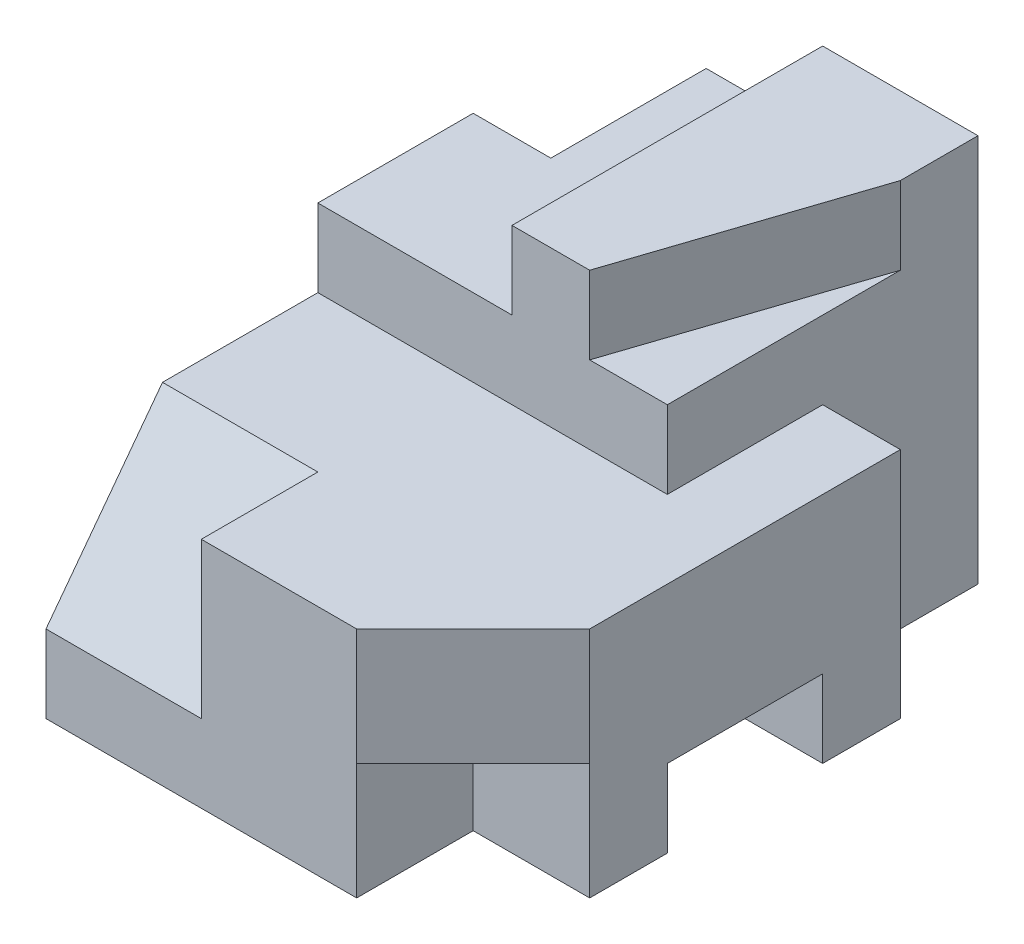
ISO-10303-21;
HEADER;
FILE_DESCRIPTION(('STEP AP214'),'2;1');
FILE_NAME('part.step','',(''),(''),'','','');
FILE_SCHEMA(('AUTOMOTIVE_DESIGN { 1 0 10303 214 1 1 1 1 }'));
ENDSEC;
DATA;
#1=APPLICATION_CONTEXT('core data for automotive mechanical design processes');
#2=APPLICATION_PROTOCOL_DEFINITION('international standard','automotive_design',2000,#1);
#3=PRODUCT_CONTEXT('',#1,'mechanical');
#4=PRODUCT('Part','Part','',(#3));
#5=PRODUCT_RELATED_PRODUCT_CATEGORY('part','',(#4));
#6=PRODUCT_DEFINITION_FORMATION('','',#4);
#7=PRODUCT_DEFINITION_CONTEXT('part definition',#1,'design');
#8=PRODUCT_DEFINITION('design','',#6,#7);
#9=PRODUCT_DEFINITION_SHAPE('','',#8);
#10=(LENGTH_UNIT() NAMED_UNIT(*) SI_UNIT(.MILLI.,.METRE.));
#11=(NAMED_UNIT(*) PLANE_ANGLE_UNIT() SI_UNIT($,.RADIAN.));
#12=(NAMED_UNIT(*) SI_UNIT($,.STERADIAN.) SOLID_ANGLE_UNIT());
#13=UNCERTAINTY_MEASURE_WITH_UNIT(LENGTH_MEASURE(1.E-05),#10,'distance_accuracy_value','');
#14=(GEOMETRIC_REPRESENTATION_CONTEXT(3) GLOBAL_UNCERTAINTY_ASSIGNED_CONTEXT((#13)) GLOBAL_UNIT_ASSIGNED_CONTEXT((#10,
#11,#12)) REPRESENTATION_CONTEXT('',''));
#15=CARTESIAN_POINT('',(0.,0.,0.));
#16=DIRECTION('',(0.,0.,1.));
#17=DIRECTION('',(1.,0.,0.));
#18=AXIS2_PLACEMENT_3D('',#15,#16,#17);
#19=CARTESIAN_POINT('',(2.75,-2.5,7.5));
#20=DIRECTION('',(0.,1.,0.));
#21=DIRECTION('',(-1.,0.,0.));
#22=AXIS2_PLACEMENT_3D('',#19,#20,#21);
#23=PLANE('',#22);
#24=DIRECTION('',(0.,0.,-1.));
#25=VECTOR('',#24,1.);
#26=CARTESIAN_POINT('',(2.75,-2.5,7.5));
#27=LINE('',#26,#25);
#28=CARTESIAN_POINT('',(2.75,-2.5,6.));
#29=VERTEX_POINT('',#28);
#30=CARTESIAN_POINT('',(2.75,-2.5,5.));
#31=VERTEX_POINT('',#30);
#32=EDGE_CURVE('E212',#29,#31,#27,.T.);
#33=ORIENTED_EDGE('',*,*,#32,.F.);
#34=DIRECTION('',(1.,0.,0.));
#35=VECTOR('',#34,1.);
#36=CARTESIAN_POINT('',(1.25,-2.5,6.));
#37=LINE('',#36,#35);
#38=CARTESIAN_POINT('',(1.25,-2.5,6.));
#39=VERTEX_POINT('',#38);
#40=EDGE_CURVE('E193',#39,#29,#37,.T.);
#41=ORIENTED_EDGE('',*,*,#40,.F.);
#42=DIRECTION('',(0.,0.,-1.));
#43=VECTOR('',#42,1.);
#44=CARTESIAN_POINT('',(1.25,-2.5,7.5));
#45=LINE('',#44,#43);
#46=CARTESIAN_POINT('',(1.25,-2.5,7.5));
#47=VERTEX_POINT('',#46);
#48=EDGE_CURVE('E200',#47,#39,#45,.T.);
#49=ORIENTED_EDGE('',*,*,#48,.F.);
#50=DIRECTION('',(1.,0.,0.));
#51=VECTOR('',#50,1.);
#52=CARTESIAN_POINT('',(2.75,-2.5,7.5));
#53=LINE('',#52,#51);
#54=CARTESIAN_POINT('',(-2.75,-2.5,7.5));
#55=VERTEX_POINT('',#54);
#56=EDGE_CURVE('E357',#55,#47,#53,.T.);
#57=ORIENTED_EDGE('',*,*,#56,.F.);
#58=DIRECTION('',(0.,0.,-1.));
#59=VECTOR('',#58,1.);
#60=CARTESIAN_POINT('',(-2.75,-2.5,7.5));
#61=LINE('',#60,#59);
#62=CARTESIAN_POINT('',(-2.75,-2.5,5.));
#63=VERTEX_POINT('',#62);
#64=EDGE_CURVE('E41',#55,#63,#61,.T.);
#65=ORIENTED_EDGE('',*,*,#64,.T.);
#66=DIRECTION('',(1.,0.,0.));
#67=VECTOR('',#66,1.);
#68=CARTESIAN_POINT('',(-2.75,-2.5,5.));
#69=LINE('',#68,#67);
#70=EDGE_CURVE('E240',#63,#31,#69,.T.);
#71=ORIENTED_EDGE('',*,*,#70,.T.);
#72=EDGE_LOOP('',(#33,#41,#49,#57,#65,#71));
#73=FACE_BOUND('',#72,.T.);
#74=ADVANCED_FACE('F33',(#73),#23,.F.);
#75=CARTESIAN_POINT('',(-2.75,-2.5,7.5));
#76=DIRECTION('',(1.,0.,0.));
#77=DIRECTION('',(0.,0.,-1.));
#78=AXIS2_PLACEMENT_3D('',#75,#76,#77);
#79=PLANE('',#78);
#80=DIRECTION('',(0.,0.,1.));
#81=VECTOR('',#80,1.);
#82=CARTESIAN_POINT('',(-2.75,-1.5,5.));
#83=LINE('',#82,#81);
#84=CARTESIAN_POINT('',(-2.75,-1.5,3.));
#85=VERTEX_POINT('',#84);
#86=CARTESIAN_POINT('',(-2.75,-1.5,5.));
#87=VERTEX_POINT('',#86);
#88=EDGE_CURVE('E225',#85,#87,#83,.T.);
#89=ORIENTED_EDGE('',*,*,#88,.T.);
#90=DIRECTION('',(0.,-1.,0.));
#91=VECTOR('',#90,1.);
#92=CARTESIAN_POINT('',(-2.75,-2.5,5.));
#93=LINE('',#92,#91);
#94=EDGE_CURVE('E229',#87,#63,#93,.T.);
#95=ORIENTED_EDGE('',*,*,#94,.T.);
#96=ORIENTED_EDGE('',*,*,#64,.F.);
#97=DIRECTION('',(0.,-1.,0.));
#98=VECTOR('',#97,1.);
#99=CARTESIAN_POINT('',(-2.75,-2.5,7.5));
#100=LINE('',#99,#98);
#101=CARTESIAN_POINT('',(-2.75,-1.5,7.5));
#102=VERTEX_POINT('',#101);
#103=EDGE_CURVE('E355',#102,#55,#100,.T.);
#104=ORIENTED_EDGE('',*,*,#103,.F.);
#105=DIRECTION('',(0.,-0.8,0.6));
#106=VECTOR('',#105,1.);
#107=CARTESIAN_POINT('',(-2.75,0.499999999999999,6.));
#108=LINE('',#107,#106);
#109=CARTESIAN_POINT('',(-2.75,0.499999999999999,6.));
#110=VERTEX_POINT('',#109);
#111=EDGE_CURVE('E296',#110,#102,#108,.T.);
#112=ORIENTED_EDGE('',*,*,#111,.F.);
#113=DIRECTION('',(0.,0.,1.));
#114=VECTOR('',#113,1.);
#115=CARTESIAN_POINT('',(-2.75,0.499999999999999,0.));
#116=LINE('',#115,#114);
#117=CARTESIAN_POINT('',(-2.75,0.499999999999999,4.));
#118=VERTEX_POINT('',#117);
#119=EDGE_CURVE('E306',#118,#110,#116,.T.);
#120=ORIENTED_EDGE('',*,*,#119,.F.);
#121=DIRECTION('',(0.,1.,0.));
#122=VECTOR('',#121,1.);
#123=CARTESIAN_POINT('',(-2.75,0.499999999999999,4.));
#124=LINE('',#123,#122);
#125=CARTESIAN_POINT('',(-2.75,1.5,4.));
#126=VERTEX_POINT('',#125);
#127=EDGE_CURVE('E317',#118,#126,#124,.T.);
#128=ORIENTED_EDGE('',*,*,#127,.T.);
#129=DIRECTION('',(0.,0.,1.));
#130=VECTOR('',#129,1.);
#131=CARTESIAN_POINT('',(-2.75,1.5,0.));
#132=LINE('',#131,#130);
#133=CARTESIAN_POINT('',(-2.75,1.5,2.));
#134=VERTEX_POINT('',#133);
#135=EDGE_CURVE('E266',#134,#126,#132,.T.);
#136=ORIENTED_EDGE('',*,*,#135,.F.);
#137=DIRECTION('',(0.,1.,0.));
#138=VECTOR('',#137,1.);
#139=CARTESIAN_POINT('',(-2.75,-2.5,2.));
#140=LINE('',#139,#138);
#141=CARTESIAN_POINT('',(-2.75,-2.5,2.));
#142=VERTEX_POINT('',#141);
#143=EDGE_CURVE('E255',#142,#134,#140,.T.);
#144=ORIENTED_EDGE('',*,*,#143,.F.);
#145=CARTESIAN_POINT('',(-2.75,-2.5,3.));
#146=VERTEX_POINT('',#145);
#147=EDGE_CURVE('E364',#146,#142,#61,.T.);
#148=ORIENTED_EDGE('',*,*,#147,.F.);
#149=DIRECTION('',(0.,1.,0.));
#150=VECTOR('',#149,1.);
#151=CARTESIAN_POINT('',(-2.75,-1.5,3.));
#152=LINE('',#151,#150);
#153=EDGE_CURVE('E55',#146,#85,#152,.T.);
#154=ORIENTED_EDGE('',*,*,#153,.T.);
#155=EDGE_LOOP('',(#89,#95,#96,#104,#112,#120,#128,#136,#144,#148,#154));
#156=FACE_BOUND('',#155,.T.);
#157=ADVANCED_FACE('F35',(#156),#79,.F.);
#158=CARTESIAN_POINT('',(2.75,-2.5,7.5));
#159=DIRECTION('',(-1.,0.,0.));
#160=DIRECTION('',(0.,0.,1.));
#161=AXIS2_PLACEMENT_3D('',#158,#159,#160);
#162=PLANE('',#161);
#163=DIRECTION('',(0.,0.,-1.));
#164=VECTOR('',#163,1.);
#165=CARTESIAN_POINT('',(2.75,0.5,2.));
#166=LINE('',#165,#164);
#167=CARTESIAN_POINT('',(2.75,0.5,6.));
#168=VERTEX_POINT('',#167);
#169=CARTESIAN_POINT('',(2.75,0.5,2.));
#170=VERTEX_POINT('',#169);
#171=EDGE_CURVE('E321',#168,#170,#166,.T.);
#172=ORIENTED_EDGE('',*,*,#171,.F.);
#173=DIRECTION('',(0.,1.,0.));
#174=VECTOR('',#173,1.);
#175=CARTESIAN_POINT('',(2.75,-2.5,6.));
#176=LINE('',#175,#174);
#177=CARTESIAN_POINT('',(2.75,-1.,6.));
#178=VERTEX_POINT('',#177);
#179=EDGE_CURVE('E47',#178,#168,#176,.T.);
#180=ORIENTED_EDGE('',*,*,#179,.F.);
#181=EDGE_CURVE('E222',#29,#178,#176,.T.);
#182=ORIENTED_EDGE('',*,*,#181,.F.);
#183=ORIENTED_EDGE('',*,*,#32,.T.);
#184=DIRECTION('',(0.,-1.,0.));
#185=VECTOR('',#184,1.);
#186=CARTESIAN_POINT('',(2.75,-2.5,5.));
#187=LINE('',#186,#185);
#188=CARTESIAN_POINT('',(2.75,-1.5,5.));
#189=VERTEX_POINT('',#188);
#190=EDGE_CURVE('E226',#189,#31,#187,.T.);
#191=ORIENTED_EDGE('',*,*,#190,.F.);
#192=DIRECTION('',(0.,0.,1.));
#193=VECTOR('',#192,1.);
#194=CARTESIAN_POINT('',(2.75,-1.5,5.));
#195=LINE('',#194,#193);
#196=CARTESIAN_POINT('',(2.75,-1.5,3.));
#197=VERTEX_POINT('',#196);
#198=EDGE_CURVE('E235',#197,#189,#195,.T.);
#199=ORIENTED_EDGE('',*,*,#198,.F.);
#200=DIRECTION('',(0.,1.,0.));
#201=VECTOR('',#200,1.);
#202=CARTESIAN_POINT('',(2.75,-1.5,3.));
#203=LINE('',#202,#201);
#204=CARTESIAN_POINT('',(2.75,-2.5,3.));
#205=VERTEX_POINT('',#204);
#206=EDGE_CURVE('E220',#205,#197,#203,.T.);
#207=ORIENTED_EDGE('',*,*,#206,.F.);
#208=CARTESIAN_POINT('',(2.75,-2.5,2.));
#209=VERTEX_POINT('',#208);
#210=EDGE_CURVE('E360',#205,#209,#27,.T.);
#211=ORIENTED_EDGE('',*,*,#210,.T.);
#212=DIRECTION('',(0.,-1.,0.));
#213=VECTOR('',#212,1.);
#214=CARTESIAN_POINT('',(2.75,-2.5,2.));
#215=LINE('',#214,#213);
#216=EDGE_CURVE('E325',#170,#209,#215,.T.);
#217=ORIENTED_EDGE('',*,*,#216,.F.);
#218=EDGE_LOOP('',(#172,#180,#182,#183,#191,#199,#207,#211,#217));
#219=FACE_BOUND('',#218,.T.);
#220=ADVANCED_FACE('F415',(#219),#162,.F.);
#221=CARTESIAN_POINT('',(2.75,2.5,7.5));
#222=DIRECTION('',(0.,-1.,0.));
#223=DIRECTION('',(1.,0.,0.));
#224=AXIS2_PLACEMENT_3D('',#221,#222,#223);
#225=PLANE('',#224);
#226=DIRECTION('',(-1.,0.,0.));
#227=VECTOR('',#226,1.);
#228=CARTESIAN_POINT('',(2.75,2.5,0.));
#229=LINE('',#228,#227);
#230=CARTESIAN_POINT('',(1.75,2.5,0.));
#231=VERTEX_POINT('',#230);
#232=CARTESIAN_POINT('',(-0.25,2.5,0.));
#233=VERTEX_POINT('',#232);
#234=EDGE_CURVE('E358',#231,#233,#229,.T.);
#235=ORIENTED_EDGE('',*,*,#234,.T.);
#236=DIRECTION('',(0.,0.,-1.));
#237=VECTOR('',#236,1.);
#238=CARTESIAN_POINT('',(-0.25,2.5,4.));
#239=LINE('',#238,#237);
#240=CARTESIAN_POINT('',(-0.25,2.5,4.));
#241=VERTEX_POINT('',#240);
#242=EDGE_CURVE('E262',#241,#233,#239,.T.);
#243=ORIENTED_EDGE('',*,*,#242,.F.);
#244=DIRECTION('',(1.,0.,0.));
#245=VECTOR('',#244,1.);
#246=CARTESIAN_POINT('',(0.,2.5,4.));
#247=LINE('',#246,#245);
#248=CARTESIAN_POINT('',(0.749999999999999,2.5,4.));
#249=VERTEX_POINT('',#248);
#250=EDGE_CURVE('E301',#241,#249,#247,.T.);
#251=ORIENTED_EDGE('',*,*,#250,.T.);
#252=DIRECTION('',(-0.316227766016838,0.,0.948683298050514));
#253=VECTOR('',#252,1.);
#254=CARTESIAN_POINT('',(1.75,2.5,1.));
#255=LINE('',#254,#253);
#256=CARTESIAN_POINT('',(1.75,2.5,1.));
#257=VERTEX_POINT('',#256);
#258=EDGE_CURVE('E282',#257,#249,#255,.T.);
#259=ORIENTED_EDGE('',*,*,#258,.F.);
#260=DIRECTION('',(0.,0.,1.));
#261=VECTOR('',#260,1.);
#262=CARTESIAN_POINT('',(1.75,2.5,4.));
#263=LINE('',#262,#261);
#264=EDGE_CURVE('E324',#231,#257,#263,.T.);
#265=ORIENTED_EDGE('',*,*,#264,.F.);
#266=EDGE_LOOP('',(#235,#243,#251,#259,#265));
#267=FACE_BOUND('',#266,.T.);
#268=ADVANCED_FACE('F393',(#267),#225,.F.);
#269=CARTESIAN_POINT('',(0.,0.,7.5));
#270=DIRECTION('',(0.,0.,1.));
#271=DIRECTION('',(1.,0.,0.));
#272=AXIS2_PLACEMENT_3D('',#269,#270,#271);
#273=PLANE('',#272);
#274=DIRECTION('',(0.,1.,0.));
#275=VECTOR('',#274,1.);
#276=CARTESIAN_POINT('',(1.25,-2.5,7.5));
#277=LINE('',#276,#275);
#278=CARTESIAN_POINT('',(1.25,-1.,7.5));
#279=VERTEX_POINT('',#278);
#280=EDGE_CURVE('E205',#47,#279,#277,.T.);
#281=ORIENTED_EDGE('',*,*,#280,.T.);
#282=CARTESIAN_POINT('',(1.25,0.5,7.5));
#283=VERTEX_POINT('',#282);
#284=EDGE_CURVE('E221',#279,#283,#277,.T.);
#285=ORIENTED_EDGE('',*,*,#284,.T.);
#286=DIRECTION('',(1.,0.,0.));
#287=VECTOR('',#286,1.);
#288=CARTESIAN_POINT('',(0.,0.5,7.5));
#289=LINE('',#288,#287);
#290=CARTESIAN_POINT('',(-0.749999999999999,0.5,7.5));
#291=VERTEX_POINT('',#290);
#292=EDGE_CURVE('E314',#291,#283,#289,.T.);
#293=ORIENTED_EDGE('',*,*,#292,.F.);
#294=DIRECTION('',(0.,1.,0.));
#295=VECTOR('',#294,1.);
#296=CARTESIAN_POINT('',(-0.75,-1.5,7.5));
#297=LINE('',#296,#295);
#298=CARTESIAN_POINT('',(-0.75,-1.5,7.5));
#299=VERTEX_POINT('',#298);
#300=EDGE_CURVE('E346',#299,#291,#297,.T.);
#301=ORIENTED_EDGE('',*,*,#300,.F.);
#302=DIRECTION('',(-1.,0.,0.));
#303=VECTOR('',#302,1.);
#304=CARTESIAN_POINT('',(-0.75,-1.5,7.5));
#305=LINE('',#304,#303);
#306=EDGE_CURVE('E351',#299,#102,#305,.T.);
#307=ORIENTED_EDGE('',*,*,#306,.T.);
#308=ORIENTED_EDGE('',*,*,#103,.T.);
#309=ORIENTED_EDGE('',*,*,#56,.T.);
#310=EDGE_LOOP('',(#281,#285,#293,#301,#307,#308,#309));
#311=FACE_BOUND('',#310,.T.);
#312=ADVANCED_FACE('F451',(#311),#273,.T.);
#313=CARTESIAN_POINT('',(-0.75,0.,0.));
#314=DIRECTION('',(1.,0.,0.));
#315=DIRECTION('',(0.,0.,-1.));
#316=AXIS2_PLACEMENT_3D('',#313,#314,#315);
#317=PLANE('',#316);
#318=ORIENTED_EDGE('',*,*,#300,.T.);
#319=DIRECTION('',(0.,0.,1.));
#320=VECTOR('',#319,1.);
#321=CARTESIAN_POINT('',(-0.749999999999999,0.5,0.));
#322=LINE('',#321,#320);
#323=CARTESIAN_POINT('',(-0.749999999999999,0.5,6.));
#324=VERTEX_POINT('',#323);
#325=EDGE_CURVE('E312',#324,#291,#322,.T.);
#326=ORIENTED_EDGE('',*,*,#325,.F.);
#327=DIRECTION('',(0.,-0.8,0.6));
#328=VECTOR('',#327,1.);
#329=CARTESIAN_POINT('',(-0.75,0.499999999999999,6.));
#330=LINE('',#329,#328);
#331=EDGE_CURVE('E298',#324,#299,#330,.T.);
#332=ORIENTED_EDGE('',*,*,#331,.T.);
#333=EDGE_LOOP('',(#318,#326,#332));
#334=FACE_BOUND('',#333,.T.);
#335=ADVANCED_FACE('F445',(#334),#317,.F.);
#336=ORIENTED_EDGE('',*,*,#210,.F.);
#337=DIRECTION('',(1.,0.,0.));
#338=VECTOR('',#337,1.);
#339=CARTESIAN_POINT('',(-2.75,-2.5,3.));
#340=LINE('',#339,#338);
#341=EDGE_CURVE('E232',#146,#205,#340,.T.);
#342=ORIENTED_EDGE('',*,*,#341,.F.);
#343=ORIENTED_EDGE('',*,*,#147,.T.);
#344=DIRECTION('',(1.,0.,0.));
#345=VECTOR('',#344,1.);
#346=CARTESIAN_POINT('',(-1.75,-2.5,2.));
#347=LINE('',#346,#345);
#348=CARTESIAN_POINT('',(-1.75,-2.5,2.));
#349=VERTEX_POINT('',#348);
#350=EDGE_CURVE('E248',#142,#349,#347,.T.);
#351=ORIENTED_EDGE('',*,*,#350,.T.);
#352=DIRECTION('',(0.,0.,-1.));
#353=VECTOR('',#352,1.);
#354=CARTESIAN_POINT('',(-1.75,-2.5,0.));
#355=LINE('',#354,#353);
#356=CARTESIAN_POINT('',(-1.75,-2.5,0.));
#357=VERTEX_POINT('',#356);
#358=EDGE_CURVE('E251',#349,#357,#355,.T.);
#359=ORIENTED_EDGE('',*,*,#358,.T.);
#360=DIRECTION('',(1.,0.,0.));
#361=VECTOR('',#360,1.);
#362=CARTESIAN_POINT('',(2.75,-2.5,0.));
#363=LINE('',#362,#361);
#364=CARTESIAN_POINT('',(1.75,-2.5,0.));
#365=VERTEX_POINT('',#364);
#366=EDGE_CURVE('E354',#357,#365,#363,.T.);
#367=ORIENTED_EDGE('',*,*,#366,.T.);
#368=DIRECTION('',(0.,0.,-1.));
#369=VECTOR('',#368,1.);
#370=CARTESIAN_POINT('',(1.75,-2.5,0.));
#371=LINE('',#370,#369);
#372=CARTESIAN_POINT('',(1.75,-2.5,2.));
#373=VERTEX_POINT('',#372);
#374=EDGE_CURVE('E336',#373,#365,#371,.T.);
#375=ORIENTED_EDGE('',*,*,#374,.F.);
#376=DIRECTION('',(1.,0.,0.));
#377=VECTOR('',#376,1.);
#378=CARTESIAN_POINT('',(1.75,-2.5,2.));
#379=LINE('',#378,#377);
#380=EDGE_CURVE('E343',#373,#209,#379,.T.);
#381=ORIENTED_EDGE('',*,*,#380,.T.);
#382=EDGE_LOOP('',(#336,#342,#343,#351,#359,#367,#375,#381));
#383=FACE_BOUND('',#382,.T.);
#384=ADVANCED_FACE('F371',(#383),#23,.F.);
#385=CARTESIAN_POINT('',(0.,0.,0.));
#386=DIRECTION('',(0.,0.,1.));
#387=DIRECTION('',(1.,0.,0.));
#388=AXIS2_PLACEMENT_3D('',#385,#386,#387);
#389=PLANE('',#388);
#390=ORIENTED_EDGE('',*,*,#366,.F.);
#391=DIRECTION('',(0.,1.,0.));
#392=VECTOR('',#391,1.);
#393=CARTESIAN_POINT('',(-1.75,-2.5,0.));
#394=LINE('',#393,#392);
#395=CARTESIAN_POINT('',(-1.75,1.5,0.));
#396=VERTEX_POINT('',#395);
#397=EDGE_CURVE('E259',#357,#396,#394,.T.);
#398=ORIENTED_EDGE('',*,*,#397,.T.);
#399=DIRECTION('',(-1.,0.,0.));
#400=VECTOR('',#399,1.);
#401=CARTESIAN_POINT('',(-0.25,1.5,0.));
#402=LINE('',#401,#400);
#403=CARTESIAN_POINT('',(-0.25,1.5,0.));
#404=VERTEX_POINT('',#403);
#405=EDGE_CURVE('E274',#404,#396,#402,.T.);
#406=ORIENTED_EDGE('',*,*,#405,.F.);
#407=DIRECTION('',(0.,1.,0.));
#408=VECTOR('',#407,1.);
#409=CARTESIAN_POINT('',(-0.25,1.5,0.));
#410=LINE('',#409,#408);
#411=EDGE_CURVE('E279',#404,#233,#410,.T.);
#412=ORIENTED_EDGE('',*,*,#411,.T.);
#413=ORIENTED_EDGE('',*,*,#234,.F.);
#414=DIRECTION('',(0.,1.,0.));
#415=VECTOR('',#414,1.);
#416=CARTESIAN_POINT('',(1.75,2.5,0.));
#417=LINE('',#416,#415);
#418=EDGE_CURVE('E322',#365,#231,#417,.T.);
#419=ORIENTED_EDGE('',*,*,#418,.F.);
#420=EDGE_LOOP('',(#390,#398,#406,#412,#413,#419));
#421=FACE_BOUND('',#420,.T.);
#422=ADVANCED_FACE('F400',(#421),#389,.F.);
#423=CARTESIAN_POINT('',(1.75,-2.5,2.));
#424=DIRECTION('',(0.,0.,1.));
#425=DIRECTION('',(1.,0.,0.));
#426=AXIS2_PLACEMENT_3D('',#423,#424,#425);
#427=PLANE('',#426);
#428=ORIENTED_EDGE('',*,*,#216,.T.);
#429=ORIENTED_EDGE('',*,*,#380,.F.);
#430=DIRECTION('',(0.,-1.,0.));
#431=VECTOR('',#430,1.);
#432=CARTESIAN_POINT('',(1.75,-2.5,2.));
#433=LINE('',#432,#431);
#434=CARTESIAN_POINT('',(1.75,0.5,2.));
#435=VERTEX_POINT('',#434);
#436=EDGE_CURVE('E333',#435,#373,#433,.T.);
#437=ORIENTED_EDGE('',*,*,#436,.F.);
#438=DIRECTION('',(1.,0.,0.));
#439=VECTOR('',#438,1.);
#440=CARTESIAN_POINT('',(1.75,0.5,2.));
#441=LINE('',#440,#439);
#442=EDGE_CURVE('E339',#435,#170,#441,.T.);
#443=ORIENTED_EDGE('',*,*,#442,.T.);
#444=EDGE_LOOP('',(#428,#429,#437,#443));
#445=FACE_BOUND('',#444,.T.);
#446=ADVANCED_FACE('F410',(#445),#427,.F.);
#447=CARTESIAN_POINT('',(1.75,0.5,2.));
#448=DIRECTION('',(0.,-1.,0.));
#449=DIRECTION('',(0.,0.,-1.));
#450=AXIS2_PLACEMENT_3D('',#447,#448,#449);
#451=PLANE('',#450);
#452=ORIENTED_EDGE('',*,*,#292,.T.);
#453=DIRECTION('',(-0.707106781186548,0.,0.707106781186547));
#454=VECTOR('',#453,1.);
#455=CARTESIAN_POINT('',(2.75,0.5,6.));
#456=LINE('',#455,#454);
#457=EDGE_CURVE('E214',#168,#283,#456,.T.);
#458=ORIENTED_EDGE('',*,*,#457,.F.);
#459=ORIENTED_EDGE('',*,*,#171,.T.);
#460=ORIENTED_EDGE('',*,*,#442,.F.);
#461=DIRECTION('',(0.,0.,-1.));
#462=VECTOR('',#461,1.);
#463=CARTESIAN_POINT('',(1.75,0.5,2.));
#464=LINE('',#463,#462);
#465=CARTESIAN_POINT('',(1.75,0.5,4.));
#466=VERTEX_POINT('',#465);
#467=EDGE_CURVE('E330',#466,#435,#464,.T.);
#468=ORIENTED_EDGE('',*,*,#467,.F.);
#469=DIRECTION('',(1.,0.,0.));
#470=VECTOR('',#469,1.);
#471=CARTESIAN_POINT('',(0.,0.5,4.));
#472=LINE('',#471,#470);
#473=EDGE_CURVE('E303',#118,#466,#472,.T.);
#474=ORIENTED_EDGE('',*,*,#473,.F.);
#475=ORIENTED_EDGE('',*,*,#119,.T.);
#476=DIRECTION('',(1.,0.,0.));
#477=VECTOR('',#476,1.);
#478=CARTESIAN_POINT('',(0.,0.5,6.));
#479=LINE('',#478,#477);
#480=EDGE_CURVE('E309',#110,#324,#479,.T.);
#481=ORIENTED_EDGE('',*,*,#480,.T.);
#482=ORIENTED_EDGE('',*,*,#325,.T.);
#483=EDGE_LOOP('',(#452,#458,#459,#460,#468,#474,#475,#481,#482));
#484=FACE_BOUND('',#483,.T.);
#485=ADVANCED_FACE('F460',(#484),#451,.F.);
#486=CARTESIAN_POINT('',(1.75,0.,0.));
#487=DIRECTION('',(-1.,0.,0.));
#488=DIRECTION('',(0.,0.,1.));
#489=AXIS2_PLACEMENT_3D('',#486,#487,#488);
#490=PLANE('',#489);
#491=ORIENTED_EDGE('',*,*,#264,.T.);
#492=DIRECTION('',(0.,1.,0.));
#493=VECTOR('',#492,1.);
#494=CARTESIAN_POINT('',(1.75,1.5,1.));
#495=LINE('',#494,#493);
#496=CARTESIAN_POINT('',(1.75,1.5,1.));
#497=VERTEX_POINT('',#496);
#498=EDGE_CURVE('E290',#497,#257,#495,.T.);
#499=ORIENTED_EDGE('',*,*,#498,.F.);
#500=DIRECTION('',(0.,0.,-1.));
#501=VECTOR('',#500,1.);
#502=CARTESIAN_POINT('',(1.75,1.5,4.));
#503=LINE('',#502,#501);
#504=CARTESIAN_POINT('',(1.75,1.5,4.));
#505=VERTEX_POINT('',#504);
#506=EDGE_CURVE('E286',#505,#497,#503,.T.);
#507=ORIENTED_EDGE('',*,*,#506,.F.);
#508=DIRECTION('',(0.,-1.,0.));
#509=VECTOR('',#508,1.);
#510=CARTESIAN_POINT('',(1.75,0.5,4.));
#511=LINE('',#510,#509);
#512=EDGE_CURVE('E328',#505,#466,#511,.T.);
#513=ORIENTED_EDGE('',*,*,#512,.T.);
#514=ORIENTED_EDGE('',*,*,#467,.T.);
#515=ORIENTED_EDGE('',*,*,#436,.T.);
#516=ORIENTED_EDGE('',*,*,#374,.T.);
#517=ORIENTED_EDGE('',*,*,#418,.T.);
#518=EDGE_LOOP('',(#491,#499,#507,#513,#514,#515,#516,#517));
#519=FACE_BOUND('',#518,.T.);
#520=ADVANCED_FACE('F406',(#519),#490,.F.);
#521=CARTESIAN_POINT('',(0.,0.5,4.));
#522=DIRECTION('',(0.,0.,1.));
#523=DIRECTION('',(1.,0.,0.));
#524=AXIS2_PLACEMENT_3D('',#521,#522,#523);
#525=PLANE('',#524);
#526=DIRECTION('',(0.,1.,0.));
#527=VECTOR('',#526,1.);
#528=CARTESIAN_POINT('',(-0.25,1.5,4.));
#529=LINE('',#528,#527);
#530=CARTESIAN_POINT('',(-0.25,1.5,4.));
#531=VERTEX_POINT('',#530);
#532=EDGE_CURVE('E277',#531,#241,#529,.T.);
#533=ORIENTED_EDGE('',*,*,#532,.F.);
#534=DIRECTION('',(1.,0.,0.));
#535=VECTOR('',#534,1.);
#536=CARTESIAN_POINT('',(-2.75,1.5,4.));
#537=LINE('',#536,#535);
#538=EDGE_CURVE('E268',#126,#531,#537,.T.);
#539=ORIENTED_EDGE('',*,*,#538,.F.);
#540=ORIENTED_EDGE('',*,*,#127,.F.);
#541=ORIENTED_EDGE('',*,*,#473,.T.);
#542=ORIENTED_EDGE('',*,*,#512,.F.);
#543=DIRECTION('',(1.,0.,0.));
#544=VECTOR('',#543,1.);
#545=CARTESIAN_POINT('',(0.749999999999999,1.5,4.));
#546=LINE('',#545,#544);
#547=CARTESIAN_POINT('',(0.749999999999999,1.5,4.));
#548=VERTEX_POINT('',#547);
#549=EDGE_CURVE('E284',#548,#505,#546,.T.);
#550=ORIENTED_EDGE('',*,*,#549,.F.);
#551=DIRECTION('',(0.,1.,0.));
#552=VECTOR('',#551,1.);
#553=CARTESIAN_POINT('',(0.749999999999999,1.5,4.));
#554=LINE('',#553,#552);
#555=EDGE_CURVE('E293',#548,#249,#554,.T.);
#556=ORIENTED_EDGE('',*,*,#555,.T.);
#557=ORIENTED_EDGE('',*,*,#250,.F.);
#558=EDGE_LOOP('',(#533,#539,#540,#541,#542,#550,#556,#557));
#559=FACE_BOUND('',#558,.T.);
#560=ADVANCED_FACE('F386',(#559),#525,.T.);
#561=CARTESIAN_POINT('',(-0.75,0.499999999999999,6.));
#562=DIRECTION('',(0.,-0.6,-0.8));
#563=DIRECTION('',(0.,0.8,-0.6));
#564=AXIS2_PLACEMENT_3D('',#561,#562,#563);
#565=PLANE('',#564);
#566=ORIENTED_EDGE('',*,*,#111,.T.);
#567=ORIENTED_EDGE('',*,*,#306,.F.);
#568=ORIENTED_EDGE('',*,*,#331,.F.);
#569=ORIENTED_EDGE('',*,*,#480,.F.);
#570=EDGE_LOOP('',(#566,#567,#568,#569));
#571=FACE_BOUND('',#570,.T.);
#572=ADVANCED_FACE('F564',(#571),#565,.F.);
#573=CARTESIAN_POINT('',(1.75,1.5,1.));
#574=DIRECTION('',(-0.948683298050514,0.,-0.316227766016838));
#575=DIRECTION('',(-0.316227766016838,0.,0.948683298050514));
#576=AXIS2_PLACEMENT_3D('',#573,#574,#575);
#577=PLANE('',#576);
#578=ORIENTED_EDGE('',*,*,#258,.T.);
#579=ORIENTED_EDGE('',*,*,#555,.F.);
#580=DIRECTION('',(-0.316227766016838,0.,0.948683298050514));
#581=VECTOR('',#580,1.);
#582=CARTESIAN_POINT('',(1.75,1.5,1.));
#583=LINE('',#582,#581);
#584=EDGE_CURVE('E288',#497,#548,#583,.T.);
#585=ORIENTED_EDGE('',*,*,#584,.F.);
#586=ORIENTED_EDGE('',*,*,#498,.T.);
#587=EDGE_LOOP('',(#578,#579,#585,#586));
#588=FACE_BOUND('',#587,.T.);
#589=ADVANCED_FACE('F556',(#588),#577,.F.);
#590=CARTESIAN_POINT('',(0.,1.5,0.));
#591=DIRECTION('',(0.,1.,0.));
#592=DIRECTION('',(-1.,0.,0.));
#593=AXIS2_PLACEMENT_3D('',#590,#591,#592);
#594=PLANE('',#593);
#595=ORIENTED_EDGE('',*,*,#549,.T.);
#596=ORIENTED_EDGE('',*,*,#506,.T.);
#597=ORIENTED_EDGE('',*,*,#584,.T.);
#598=EDGE_LOOP('',(#595,#596,#597));
#599=FACE_BOUND('',#598,.T.);
#600=ADVANCED_FACE('F549',(#599),#594,.T.);
#601=CARTESIAN_POINT('',(-0.25,1.5,4.));
#602=DIRECTION('',(1.,0.,0.));
#603=DIRECTION('',(0.,1.,0.));
#604=AXIS2_PLACEMENT_3D('',#601,#602,#603);
#605=PLANE('',#604);
#606=ORIENTED_EDGE('',*,*,#242,.T.);
#607=ORIENTED_EDGE('',*,*,#411,.F.);
#608=DIRECTION('',(0.,0.,-1.));
#609=VECTOR('',#608,1.);
#610=CARTESIAN_POINT('',(-0.25,1.5,4.));
#611=LINE('',#610,#609);
#612=EDGE_CURVE('E271',#531,#404,#611,.T.);
#613=ORIENTED_EDGE('',*,*,#612,.F.);
#614=ORIENTED_EDGE('',*,*,#532,.T.);
#615=EDGE_LOOP('',(#606,#607,#613,#614));
#616=FACE_BOUND('',#615,.T.);
#617=ADVANCED_FACE('F391',(#616),#605,.F.);
#618=CARTESIAN_POINT('',(0.,1.5,0.));
#619=DIRECTION('',(0.,1.,0.));
#620=DIRECTION('',(-1.,0.,0.));
#621=AXIS2_PLACEMENT_3D('',#618,#619,#620);
#622=PLANE('',#621);
#623=DIRECTION('',(0.,0.,-1.));
#624=VECTOR('',#623,1.);
#625=CARTESIAN_POINT('',(-1.75,1.5,0.));
#626=LINE('',#625,#624);
#627=CARTESIAN_POINT('',(-1.75,1.5,2.));
#628=VERTEX_POINT('',#627);
#629=EDGE_CURVE('E252',#628,#396,#626,.T.);
#630=ORIENTED_EDGE('',*,*,#629,.F.);
#631=DIRECTION('',(1.,0.,0.));
#632=VECTOR('',#631,1.);
#633=CARTESIAN_POINT('',(-1.75,1.5,2.));
#634=LINE('',#633,#632);
#635=EDGE_CURVE('E242',#134,#628,#634,.T.);
#636=ORIENTED_EDGE('',*,*,#635,.F.);
#637=ORIENTED_EDGE('',*,*,#135,.T.);
#638=ORIENTED_EDGE('',*,*,#538,.T.);
#639=ORIENTED_EDGE('',*,*,#612,.T.);
#640=ORIENTED_EDGE('',*,*,#405,.T.);
#641=EDGE_LOOP('',(#630,#636,#637,#638,#639,#640));
#642=FACE_BOUND('',#641,.T.);
#643=ADVANCED_FACE('F383',(#642),#622,.T.);
#644=CARTESIAN_POINT('',(-1.75,-2.5,0.));
#645=DIRECTION('',(1.,0.,0.));
#646=DIRECTION('',(0.,1.,0.));
#647=AXIS2_PLACEMENT_3D('',#644,#645,#646);
#648=PLANE('',#647);
#649=ORIENTED_EDGE('',*,*,#629,.T.);
#650=ORIENTED_EDGE('',*,*,#397,.F.);
#651=ORIENTED_EDGE('',*,*,#358,.F.);
#652=DIRECTION('',(0.,1.,0.));
#653=VECTOR('',#652,1.);
#654=CARTESIAN_POINT('',(-1.75,-2.5,2.));
#655=LINE('',#654,#653);
#656=EDGE_CURVE('E263',#349,#628,#655,.T.);
#657=ORIENTED_EDGE('',*,*,#656,.T.);
#658=EDGE_LOOP('',(#649,#650,#651,#657));
#659=FACE_BOUND('',#658,.T.);
#660=ADVANCED_FACE('F403',(#659),#648,.F.);
#661=CARTESIAN_POINT('',(-1.75,-2.5,2.));
#662=DIRECTION('',(0.,0.,1.));
#663=DIRECTION('',(1.,0.,0.));
#664=AXIS2_PLACEMENT_3D('',#661,#662,#663);
#665=PLANE('',#664);
#666=ORIENTED_EDGE('',*,*,#635,.T.);
#667=ORIENTED_EDGE('',*,*,#656,.F.);
#668=ORIENTED_EDGE('',*,*,#350,.F.);
#669=ORIENTED_EDGE('',*,*,#143,.T.);
#670=EDGE_LOOP('',(#666,#667,#668,#669));
#671=FACE_BOUND('',#670,.T.);
#672=ADVANCED_FACE('F375',(#671),#665,.F.);
#673=CARTESIAN_POINT('',(-2.75,-2.5,5.));
#674=DIRECTION('',(0.,0.,1.));
#675=DIRECTION('',(1.,0.,0.));
#676=AXIS2_PLACEMENT_3D('',#673,#674,#675);
#677=PLANE('',#676);
#678=ORIENTED_EDGE('',*,*,#190,.T.);
#679=ORIENTED_EDGE('',*,*,#70,.F.);
#680=ORIENTED_EDGE('',*,*,#94,.F.);
#681=DIRECTION('',(1.,0.,0.));
#682=VECTOR('',#681,1.);
#683=CARTESIAN_POINT('',(-2.75,-1.5,5.));
#684=LINE('',#683,#682);
#685=EDGE_CURVE('E243',#87,#189,#684,.T.);
#686=ORIENTED_EDGE('',*,*,#685,.T.);
#687=EDGE_LOOP('',(#678,#679,#680,#686));
#688=FACE_BOUND('',#687,.T.);
#689=ADVANCED_FACE('F425',(#688),#677,.F.);
#690=CARTESIAN_POINT('',(-2.75,-1.5,5.));
#691=DIRECTION('',(0.,1.,0.));
#692=DIRECTION('',(0.,0.,1.));
#693=AXIS2_PLACEMENT_3D('',#690,#691,#692);
#694=PLANE('',#693);
#695=ORIENTED_EDGE('',*,*,#198,.T.);
#696=ORIENTED_EDGE('',*,*,#685,.F.);
#697=ORIENTED_EDGE('',*,*,#88,.F.);
#698=DIRECTION('',(1.,0.,0.));
#699=VECTOR('',#698,1.);
#700=CARTESIAN_POINT('',(-2.75,-1.5,3.));
#701=LINE('',#700,#699);
#702=EDGE_CURVE('E245',#85,#197,#701,.T.);
#703=ORIENTED_EDGE('',*,*,#702,.T.);
#704=EDGE_LOOP('',(#695,#696,#697,#703));
#705=FACE_BOUND('',#704,.T.);
#706=ADVANCED_FACE('F421',(#705),#694,.F.);
#707=CARTESIAN_POINT('',(-2.75,-1.5,3.));
#708=DIRECTION('',(0.,0.,-1.));
#709=DIRECTION('',(0.,1.,0.));
#710=AXIS2_PLACEMENT_3D('',#707,#708,#709);
#711=PLANE('',#710);
#712=ORIENTED_EDGE('',*,*,#206,.T.);
#713=ORIENTED_EDGE('',*,*,#702,.F.);
#714=ORIENTED_EDGE('',*,*,#153,.F.);
#715=ORIENTED_EDGE('',*,*,#341,.T.);
#716=EDGE_LOOP('',(#712,#713,#714,#715));
#717=FACE_BOUND('',#716,.T.);
#718=ADVANCED_FACE('F418',(#717),#711,.F.);
#719=CARTESIAN_POINT('',(2.75,-2.5,6.));
#720=DIRECTION('',(-0.707106781186547,0.,-0.707106781186548));
#721=DIRECTION('',(-0.707106781186548,0.,0.707106781186547));
#722=AXIS2_PLACEMENT_3D('',#719,#720,#721);
#723=PLANE('',#722);
#724=ORIENTED_EDGE('',*,*,#284,.F.);
#725=DIRECTION('',(0.707106781186548,0.,-0.707106781186547));
#726=VECTOR('',#725,1.);
#727=CARTESIAN_POINT('',(2.75,-1.,6.));
#728=LINE('',#727,#726);
#729=EDGE_CURVE('E11',#279,#178,#728,.T.);
#730=ORIENTED_EDGE('',*,*,#729,.T.);
#731=ORIENTED_EDGE('',*,*,#179,.T.);
#732=ORIENTED_EDGE('',*,*,#457,.T.);
#733=EDGE_LOOP('',(#724,#730,#731,#732));
#734=FACE_BOUND('',#733,.T.);
#735=ADVANCED_FACE('F427',(#734),#723,.F.);
#736=CARTESIAN_POINT('',(1.25,-1.,6.));
#737=DIRECTION('',(0.,1.,0.));
#738=DIRECTION('',(0.,0.,1.));
#739=AXIS2_PLACEMENT_3D('',#736,#737,#738);
#740=PLANE('',#739);
#741=DIRECTION('',(0.,0.,1.));
#742=VECTOR('',#741,1.);
#743=CARTESIAN_POINT('',(1.25,-1.,6.));
#744=LINE('',#743,#742);
#745=CARTESIAN_POINT('',(1.25,-1.,6.));
#746=VERTEX_POINT('',#745);
#747=EDGE_CURVE('E199',#746,#279,#744,.T.);
#748=ORIENTED_EDGE('',*,*,#747,.F.);
#749=DIRECTION('',(1.,0.,0.));
#750=VECTOR('',#749,1.);
#751=CARTESIAN_POINT('',(1.25,-1.,6.));
#752=LINE('',#751,#750);
#753=EDGE_CURVE('E195',#746,#178,#752,.T.);
#754=ORIENTED_EDGE('',*,*,#753,.T.);
#755=ORIENTED_EDGE('',*,*,#729,.F.);
#756=EDGE_LOOP('',(#748,#754,#755));
#757=FACE_BOUND('',#756,.T.);
#758=ADVANCED_FACE('F429',(#757),#740,.F.);
#759=CARTESIAN_POINT('',(1.25,-2.5,6.));
#760=DIRECTION('',(0.,0.,-1.));
#761=DIRECTION('',(-1.,0.,0.));
#762=AXIS2_PLACEMENT_3D('',#759,#760,#761);
#763=PLANE('',#762);
#764=ORIENTED_EDGE('',*,*,#181,.T.);
#765=ORIENTED_EDGE('',*,*,#753,.F.);
#766=DIRECTION('',(0.,1.,0.));
#767=VECTOR('',#766,1.);
#768=CARTESIAN_POINT('',(1.25,-2.5,6.));
#769=LINE('',#768,#767);
#770=EDGE_CURVE('E188',#39,#746,#769,.T.);
#771=ORIENTED_EDGE('',*,*,#770,.F.);
#772=ORIENTED_EDGE('',*,*,#40,.T.);
#773=EDGE_LOOP('',(#764,#765,#771,#772));
#774=FACE_BOUND('',#773,.T.);
#775=ADVANCED_FACE('F191',(#774),#763,.F.);
#776=CARTESIAN_POINT('',(1.25,0.,0.));
#777=DIRECTION('',(1.,0.,0.));
#778=DIRECTION('',(0.,0.,-1.));
#779=AXIS2_PLACEMENT_3D('',#776,#777,#778);
#780=PLANE('',#779);
#781=ORIENTED_EDGE('',*,*,#48,.T.);
#782=ORIENTED_EDGE('',*,*,#770,.T.);
#783=ORIENTED_EDGE('',*,*,#747,.T.);
#784=ORIENTED_EDGE('',*,*,#280,.F.);
#785=EDGE_LOOP('',(#781,#782,#783,#784));
#786=FACE_BOUND('',#785,.T.);
#787=ADVANCED_FACE('F203',(#786),#780,.T.);
#788=CLOSED_SHELL('',(#74,#157,#220,#268,#312,#335,#384,#422,#446,#485,#520,#560,#572,#589,#600,
#617,#643,#660,#672,#689,#706,#718,#735,#758,#775,#787));
#789=MANIFOLD_SOLID_BREP('B2',#788);
#790=ADVANCED_BREP_SHAPE_REPRESENTATION('',(#18,#789),#14);
#791=SHAPE_DEFINITION_REPRESENTATION(#9,#790);
ENDSEC;
END-ISO-10303-21;
